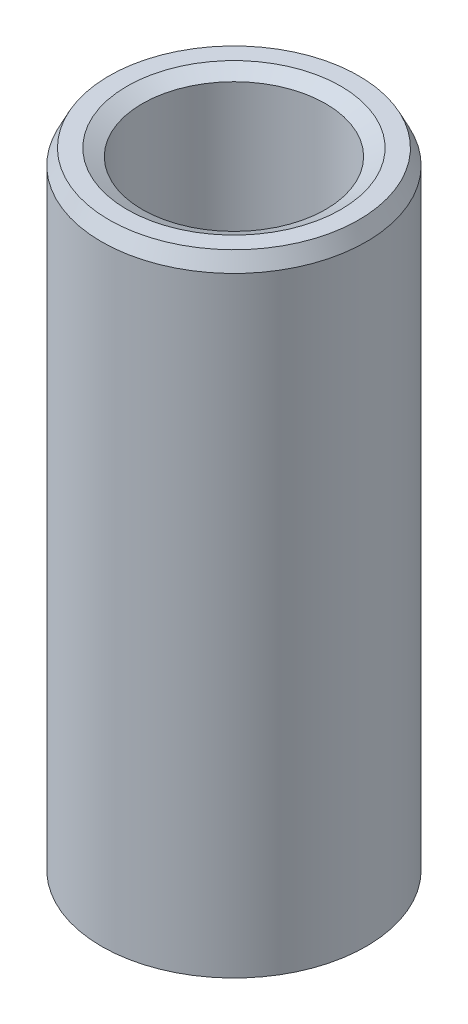
ISO-10303-21;
HEADER;
FILE_DESCRIPTION(('STEP AP214'),'2;1');
FILE_NAME('part.step','',(''),(''),'','','');
FILE_SCHEMA(('AUTOMOTIVE_DESIGN { 1 0 10303 214 1 1 1 1 }'));
ENDSEC;
DATA;
#1=APPLICATION_CONTEXT('core data for automotive mechanical design processes');
#2=APPLICATION_PROTOCOL_DEFINITION('international standard','automotive_design',2000,#1);
#3=PRODUCT_CONTEXT('',#1,'mechanical');
#4=PRODUCT('Part','Part','',(#3));
#5=PRODUCT_RELATED_PRODUCT_CATEGORY('part','',(#4));
#6=PRODUCT_DEFINITION_FORMATION('','',#4);
#7=PRODUCT_DEFINITION_CONTEXT('part definition',#1,'design');
#8=PRODUCT_DEFINITION('design','',#6,#7);
#9=PRODUCT_DEFINITION_SHAPE('','',#8);
#10=(LENGTH_UNIT() NAMED_UNIT(*) SI_UNIT(.MILLI.,.METRE.));
#11=(NAMED_UNIT(*) PLANE_ANGLE_UNIT() SI_UNIT($,.RADIAN.));
#12=(NAMED_UNIT(*) SI_UNIT($,.STERADIAN.) SOLID_ANGLE_UNIT());
#13=UNCERTAINTY_MEASURE_WITH_UNIT(LENGTH_MEASURE(1.E-05),#10,'distance_accuracy_value','');
#14=(GEOMETRIC_REPRESENTATION_CONTEXT(3) GLOBAL_UNCERTAINTY_ASSIGNED_CONTEXT((#13)) GLOBAL_UNIT_ASSIGNED_CONTEXT((#10,
#11,#12)) REPRESENTATION_CONTEXT('',''));
#15=CARTESIAN_POINT('',(0.,0.,0.));
#16=DIRECTION('',(0.,0.,1.));
#17=DIRECTION('',(1.,0.,0.));
#18=AXIS2_PLACEMENT_3D('',#15,#16,#17);
#19=CARTESIAN_POINT('',(0.,47.8149671186812,0.));
#20=DIRECTION('',(0.,-1.,0.));
#21=DIRECTION('',(0.,0.,-1.));
#22=AXIS2_PLACEMENT_3D('',#19,#20,#21);
#23=CYLINDRICAL_SURFACE('',#22,10.);
#24=CARTESIAN_POINT('',(0.,0.570552783327981,0.));
#25=DIRECTION('',(0.,1.,0.));
#26=DIRECTION('',(0.,0.,1.));
#27=AXIS2_PLACEMENT_3D('',#24,#25,#26);
#28=CIRCLE('',#27,10.);
#29=CARTESIAN_POINT('',(0.,0.570552783327981,10.));
#30=VERTEX_POINT('',#29);
#31=EDGE_CURVE('E10',#30,#30,#28,.T.);
#32=ORIENTED_EDGE('',*,*,#31,.T.);
#33=EDGE_LOOP('',(#32));
#34=FACE_BOUND('',#33,.T.);
#35=CARTESIAN_POINT('',(0.,46.6675272212153,0.));
#36=DIRECTION('',(0.,1.,0.));
#37=DIRECTION('',(0.,0.,1.));
#38=AXIS2_PLACEMENT_3D('',#35,#36,#37);
#39=CIRCLE('',#38,10.);
#40=CARTESIAN_POINT('',(0.,46.6675272212153,10.));
#41=VERTEX_POINT('',#40);
#42=EDGE_CURVE('E50',#41,#41,#39,.F.);
#43=ORIENTED_EDGE('',*,*,#42,.T.);
#44=EDGE_LOOP('',(#43));
#45=FACE_BOUND('',#44,.T.);
#46=ADVANCED_FACE('F39',(#34,#45),#23,.T.);
#47=CARTESIAN_POINT('',(0.,47.8149671186812,0.));
#48=DIRECTION('',(0.,1.,0.));
#49=DIRECTION('',(0.,0.,1.));
#50=AXIS2_PLACEMENT_3D('',#47,#48,#49);
#51=PLANE('',#50);
#52=CARTESIAN_POINT('',(0.,47.8149671186812,0.));
#53=DIRECTION('',(0.,1.,0.));
#54=DIRECTION('',(0.,0.,1.));
#55=AXIS2_PLACEMENT_3D('',#52,#53,#54);
#56=CIRCLE('',#55,8.07531676823905);
#57=CARTESIAN_POINT('',(0.,47.8149671186812,8.07531676823905));
#58=VERTEX_POINT('',#57);
#59=EDGE_CURVE('E58',#58,#58,#56,.F.);
#60=ORIENTED_EDGE('',*,*,#59,.T.);
#61=EDGE_LOOP('',(#60));
#62=FACE_BOUND('',#61,.T.);
#63=CARTESIAN_POINT('',(0.,47.8149671186812,0.));
#64=DIRECTION('',(0.,1.,0.));
#65=DIRECTION('',(0.,0.,1.));
#66=AXIS2_PLACEMENT_3D('',#63,#64,#65);
#67=CIRCLE('',#66,9.42944721667202);
#68=CARTESIAN_POINT('',(0.,47.8149671186812,9.42944721667202));
#69=VERTEX_POINT('',#68);
#70=EDGE_CURVE('E61',#69,#69,#67,.T.);
#71=ORIENTED_EDGE('',*,*,#70,.T.);
#72=EDGE_LOOP('',(#71));
#73=FACE_BOUND('',#72,.T.);
#74=ADVANCED_FACE('F88',(#62,#73),#51,.T.);
#75=CARTESIAN_POINT('',(0.,0.,0.));
#76=DIRECTION('',(0.,1.,0.));
#77=DIRECTION('',(0.,0.,1.));
#78=AXIS2_PLACEMENT_3D('',#75,#76,#77);
#79=PLANE('',#78);
#80=CARTESIAN_POINT('',(0.,0.,0.));
#81=DIRECTION('',(0.,1.,0.));
#82=DIRECTION('',(0.,0.,1.));
#83=AXIS2_PLACEMENT_3D('',#80,#81,#82);
#84=CIRCLE('',#83,7.49842965410115);
#85=CARTESIAN_POINT('',(0.,0.,7.49842965410115));
#86=VERTEX_POINT('',#85);
#87=EDGE_CURVE('E51',#86,#86,#84,.T.);
#88=ORIENTED_EDGE('',*,*,#87,.T.);
#89=EDGE_LOOP('',(#88));
#90=FACE_BOUND('',#89,.T.);
#91=CARTESIAN_POINT('',(0.,0.,0.));
#92=DIRECTION('',(0.,1.,0.));
#93=DIRECTION('',(0.,0.,1.));
#94=AXIS2_PLACEMENT_3D('',#91,#92,#93);
#95=CIRCLE('',#94,8.85256010253414);
#96=CARTESIAN_POINT('',(0.,0.,8.85256010253414));
#97=VERTEX_POINT('',#96);
#98=EDGE_CURVE('E54',#97,#97,#95,.F.);
#99=ORIENTED_EDGE('',*,*,#98,.T.);
#100=EDGE_LOOP('',(#99));
#101=FACE_BOUND('',#100,.T.);
#102=ADVANCED_FACE('F83',(#90,#101),#79,.F.);
#103=CARTESIAN_POINT('',(0.,47.8149671186812,0.));
#104=DIRECTION('',(0.,-1.,0.));
#105=DIRECTION('',(0.,0.,-1.));
#106=AXIS2_PLACEMENT_3D('',#103,#104,#105);
#107=CYLINDRICAL_SURFACE('',#106,6.92787687077317);
#108=CARTESIAN_POINT('',(0.,47.2444143353532,0.));
#109=DIRECTION('',(0.,1.,0.));
#110=DIRECTION('',(0.,0.,1.));
#111=AXIS2_PLACEMENT_3D('',#108,#109,#110);
#112=CIRCLE('',#111,6.92787687077317);
#113=CARTESIAN_POINT('',(0.,47.2444143353532,6.92787687077317));
#114=VERTEX_POINT('',#113);
#115=EDGE_CURVE('E67',#114,#114,#112,.T.);
#116=ORIENTED_EDGE('',*,*,#115,.T.);
#117=EDGE_LOOP('',(#116));
#118=FACE_BOUND('',#117,.T.);
#119=CARTESIAN_POINT('',(0.,1.14743989746586,0.));
#120=DIRECTION('',(0.,1.,0.));
#121=DIRECTION('',(0.,0.,1.));
#122=AXIS2_PLACEMENT_3D('',#119,#120,#121);
#123=CIRCLE('',#122,6.92787687077317);
#124=CARTESIAN_POINT('',(0.,1.14743989746586,6.92787687077317));
#125=VERTEX_POINT('',#124);
#126=EDGE_CURVE('E69',#125,#125,#123,.F.);
#127=ORIENTED_EDGE('',*,*,#126,.T.);
#128=EDGE_LOOP('',(#127));
#129=FACE_BOUND('',#128,.T.);
#130=ADVANCED_FACE('F71',(#118,#129),#107,.F.);
#131=CARTESIAN_POINT('',(0.,47.2444143353532,0.));
#132=DIRECTION('',(0.,1.,0.));
#133=DIRECTION('',(0.,0.,1.));
#134=AXIS2_PLACEMENT_3D('',#131,#132,#133);
#135=CONICAL_SURFACE('',#134,6.92787687077317,1.10935931613093);
#136=ORIENTED_EDGE('',*,*,#59,.F.);
#137=EDGE_LOOP('',(#136));
#138=FACE_BOUND('',#137,.T.);
#139=ORIENTED_EDGE('',*,*,#115,.F.);
#140=EDGE_LOOP('',(#139));
#141=FACE_BOUND('',#140,.T.);
#142=ADVANCED_FACE('F77',(#138,#141),#135,.F.);
#143=CARTESIAN_POINT('',(0.,0.,0.));
#144=DIRECTION('',(0.,-1.,0.));
#145=DIRECTION('',(0.,0.,-1.));
#146=AXIS2_PLACEMENT_3D('',#143,#144,#145);
#147=CONICAL_SURFACE('',#146,7.49842965410115,0.461437010663975);
#148=ORIENTED_EDGE('',*,*,#126,.F.);
#149=EDGE_LOOP('',(#148));
#150=FACE_BOUND('',#149,.T.);
#151=ORIENTED_EDGE('',*,*,#87,.F.);
#152=EDGE_LOOP('',(#151));
#153=FACE_BOUND('',#152,.T.);
#154=ADVANCED_FACE('F73',(#150,#153),#147,.F.);
#155=CARTESIAN_POINT('',(0.,0.570552783327981,0.));
#156=DIRECTION('',(0.,1.,0.));
#157=DIRECTION('',(0.,0.,1.));
#158=AXIS2_PLACEMENT_3D('',#155,#156,#157);
#159=CONICAL_SURFACE('',#158,10.,1.10935931613092);
#160=ORIENTED_EDGE('',*,*,#98,.F.);
#161=EDGE_LOOP('',(#160));
#162=FACE_BOUND('',#161,.T.);
#163=ORIENTED_EDGE('',*,*,#31,.F.);
#164=EDGE_LOOP('',(#163));
#165=FACE_BOUND('',#164,.T.);
#166=ADVANCED_FACE('F76',(#162,#165),#159,.T.);
#167=CARTESIAN_POINT('',(0.,47.8149671186812,0.));
#168=DIRECTION('',(0.,-1.,0.));
#169=DIRECTION('',(0.,0.,-1.));
#170=AXIS2_PLACEMENT_3D('',#167,#168,#169);
#171=CONICAL_SURFACE('',#170,9.42944721667202,0.461437010663971);
#172=ORIENTED_EDGE('',*,*,#42,.F.);
#173=EDGE_LOOP('',(#172));
#174=FACE_BOUND('',#173,.T.);
#175=ORIENTED_EDGE('',*,*,#70,.F.);
#176=EDGE_LOOP('',(#175));
#177=FACE_BOUND('',#176,.T.);
#178=ADVANCED_FACE('F45',(#174,#177),#171,.T.);
#179=CLOSED_SHELL('',(#46,#74,#102,#130,#142,#154,#166,#178));
#180=MANIFOLD_SOLID_BREP('B2',#179);
#181=ADVANCED_BREP_SHAPE_REPRESENTATION('',(#18,#180),#14);
#182=SHAPE_DEFINITION_REPRESENTATION(#9,#181);
ENDSEC;
END-ISO-10303-21;
